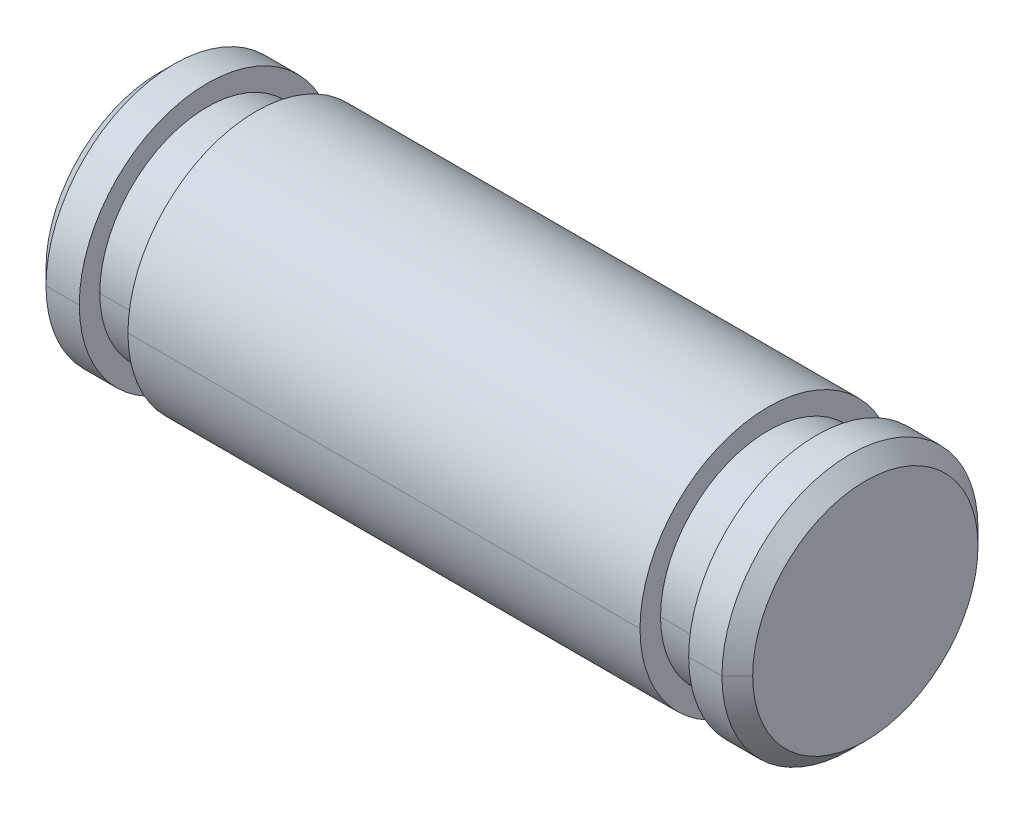
ISO-10303-21;
HEADER;
FILE_DESCRIPTION(('STEP AP214'),'2;1');
FILE_NAME('part.step','',(''),(''),'','','');
FILE_SCHEMA(('AUTOMOTIVE_DESIGN { 1 0 10303 214 1 1 1 1 }'));
ENDSEC;
DATA;
#1=APPLICATION_CONTEXT('core data for automotive mechanical design processes');
#2=APPLICATION_PROTOCOL_DEFINITION('international standard','automotive_design',2000,#1);
#3=PRODUCT_CONTEXT('',#1,'mechanical');
#4=PRODUCT('Part','Part','',(#3));
#5=PRODUCT_RELATED_PRODUCT_CATEGORY('part','',(#4));
#6=PRODUCT_DEFINITION_FORMATION('','',#4);
#7=PRODUCT_DEFINITION_CONTEXT('part definition',#1,'design');
#8=PRODUCT_DEFINITION('design','',#6,#7);
#9=PRODUCT_DEFINITION_SHAPE('','',#8);
#10=(LENGTH_UNIT() NAMED_UNIT(*) SI_UNIT(.MILLI.,.METRE.));
#11=(NAMED_UNIT(*) PLANE_ANGLE_UNIT() SI_UNIT($,.RADIAN.));
#12=(NAMED_UNIT(*) SI_UNIT($,.STERADIAN.) SOLID_ANGLE_UNIT());
#13=UNCERTAINTY_MEASURE_WITH_UNIT(LENGTH_MEASURE(1.E-05),#10,'distance_accuracy_value','');
#14=(GEOMETRIC_REPRESENTATION_CONTEXT(3) GLOBAL_UNCERTAINTY_ASSIGNED_CONTEXT((#13)) GLOBAL_UNIT_ASSIGNED_CONTEXT((#10,
#11,#12)) REPRESENTATION_CONTEXT('',''));
#15=CARTESIAN_POINT('',(0.,0.,0.));
#16=DIRECTION('',(0.,0.,1.));
#17=DIRECTION('',(1.,0.,0.));
#18=AXIS2_PLACEMENT_3D('',#15,#16,#17);
#19=CARTESIAN_POINT('',(8.382,0.,0.));
#20=DIRECTION('',(-1.,0.,0.));
#21=DIRECTION('',(0.,-1.,0.));
#22=AXIS2_PLACEMENT_3D('',#19,#20,#21);
#23=CONICAL_SURFACE('',#22,3.175,0.7853981634);
#24=CARTESIAN_POINT('',(8.763,0.,0.));
#25=DIRECTION('',(1.,0.,0.));
#26=DIRECTION('',(0.,0.,-1.));
#27=AXIS2_PLACEMENT_3D('',#24,#25,#26);
#28=CIRCLE('',#27,2.794);
#29=CARTESIAN_POINT('',(8.763,0.,-2.794));
#30=VERTEX_POINT('',#29);
#31=CARTESIAN_POINT('',(8.76299999999903,0.,2.79399999999903));
#32=VERTEX_POINT('',#31);
#33=EDGE_CURVE('E11',#30,#32,#28,.T.);
#34=ORIENTED_EDGE('',*,*,#33,.F.);
#35=DIRECTION('',(-0.707106781184743,0.,-0.707106781188353));
#36=VECTOR('',#35,1.);
#37=CARTESIAN_POINT('',(8.76299999999903,0.,-2.79399999999903));
#38=LINE('',#37,#36);
#39=CARTESIAN_POINT('',(8.382,0.,-3.175));
#40=VERTEX_POINT('',#39);
#41=EDGE_CURVE('E25',#30,#40,#38,.T.);
#42=ORIENTED_EDGE('',*,*,#41,.T.);
#43=CARTESIAN_POINT('',(8.382,0.,0.));
#44=DIRECTION('',(1.,0.,0.));
#45=DIRECTION('',(0.,0.,-1.));
#46=AXIS2_PLACEMENT_3D('',#43,#44,#45);
#47=CIRCLE('',#46,3.175);
#48=CARTESIAN_POINT('',(8.382,0.,3.175));
#49=VERTEX_POINT('',#48);
#50=EDGE_CURVE('E263',#40,#49,#47,.T.);
#51=ORIENTED_EDGE('',*,*,#50,.T.);
#52=DIRECTION('',(-0.707106781184743,0.,0.707106781188353));
#53=VECTOR('',#52,1.);
#54=CARTESIAN_POINT('',(8.76299999999903,0.,2.79399999999903));
#55=LINE('',#54,#53);
#56=EDGE_CURVE('E258',#32,#49,#55,.T.);
#57=ORIENTED_EDGE('',*,*,#56,.F.);
#58=EDGE_LOOP('',(#34,#42,#51,#57));
#59=FACE_BOUND('',#58,.T.);
#60=ADVANCED_FACE('F17',(#59),#23,.T.);
#61=CARTESIAN_POINT('',(8.382,0.,0.));
#62=DIRECTION('',(-1.,0.,0.));
#63=DIRECTION('',(0.,1.,0.));
#64=AXIS2_PLACEMENT_3D('',#61,#62,#63);
#65=CONICAL_SURFACE('',#64,3.175,0.7853981634);
#66=CARTESIAN_POINT('',(8.382,0.,0.));
#67=DIRECTION('',(1.,0.,0.));
#68=DIRECTION('',(0.,0.,-1.));
#69=AXIS2_PLACEMENT_3D('',#66,#67,#68);
#70=CIRCLE('',#69,3.175);
#71=EDGE_CURVE('E254',#49,#40,#70,.T.);
#72=ORIENTED_EDGE('',*,*,#71,.T.);
#73=ORIENTED_EDGE('',*,*,#41,.F.);
#74=CARTESIAN_POINT('',(8.763,0.,0.));
#75=DIRECTION('',(1.,0.,0.));
#76=DIRECTION('',(0.,0.,-1.));
#77=AXIS2_PLACEMENT_3D('',#74,#75,#76);
#78=CIRCLE('',#77,2.794);
#79=EDGE_CURVE('E249',#32,#30,#78,.T.);
#80=ORIENTED_EDGE('',*,*,#79,.F.);
#81=ORIENTED_EDGE('',*,*,#56,.T.);
#82=EDGE_LOOP('',(#72,#73,#80,#81));
#83=FACE_BOUND('',#82,.T.);
#84=ADVANCED_FACE('F277',(#83),#65,.T.);
#85=CARTESIAN_POINT('',(8.763,2.794,0.));
#86=DIRECTION('',(-1.,0.,0.));
#87=DIRECTION('',(0.,0.,1.));
#88=AXIS2_PLACEMENT_3D('',#85,#86,#87);
#89=PLANE('',#88);
#90=ORIENTED_EDGE('',*,*,#33,.T.);
#91=ORIENTED_EDGE('',*,*,#79,.T.);
#92=EDGE_LOOP('',(#90,#91));
#93=FACE_BOUND('',#92,.T.);
#94=ADVANCED_FACE('F355',(#93),#89,.F.);
#95=CARTESIAN_POINT('',(8.763,0.,0.));
#96=DIRECTION('',(-1.,0.,0.));
#97=DIRECTION('',(0.,1.,0.));
#98=AXIS2_PLACEMENT_3D('',#95,#96,#97);
#99=CYLINDRICAL_SURFACE('',#98,3.175);
#100=CARTESIAN_POINT('',(7.5565,0.,0.));
#101=DIRECTION('',(1.,0.,0.));
#102=DIRECTION('',(0.,0.,-1.));
#103=AXIS2_PLACEMENT_3D('',#100,#101,#102);
#104=CIRCLE('',#103,3.175);
#105=CARTESIAN_POINT('',(7.5565,0.,3.175));
#106=VERTEX_POINT('',#105);
#107=CARTESIAN_POINT('',(7.5565,0.,-3.175));
#108=VERTEX_POINT('',#107);
#109=EDGE_CURVE('E245',#106,#108,#104,.T.);
#110=ORIENTED_EDGE('',*,*,#109,.T.);
#111=DIRECTION('',(-1.,0.,0.));
#112=VECTOR('',#111,1.);
#113=CARTESIAN_POINT('',(8.382,0.,-3.175));
#114=LINE('',#113,#112);
#115=EDGE_CURVE('E240',#40,#108,#114,.T.);
#116=ORIENTED_EDGE('',*,*,#115,.F.);
#117=ORIENTED_EDGE('',*,*,#71,.F.);
#118=DIRECTION('',(-1.,0.,0.));
#119=VECTOR('',#118,1.);
#120=CARTESIAN_POINT('',(8.382,0.,3.175));
#121=LINE('',#120,#119);
#122=EDGE_CURVE('E236',#49,#106,#121,.T.);
#123=ORIENTED_EDGE('',*,*,#122,.T.);
#124=EDGE_LOOP('',(#110,#116,#117,#123));
#125=FACE_BOUND('',#124,.T.);
#126=ADVANCED_FACE('F280',(#125),#99,.T.);
#127=CARTESIAN_POINT('',(8.763,0.,0.));
#128=DIRECTION('',(-1.,0.,0.));
#129=DIRECTION('',(0.,-1.,0.));
#130=AXIS2_PLACEMENT_3D('',#127,#128,#129);
#131=CYLINDRICAL_SURFACE('',#130,3.175);
#132=ORIENTED_EDGE('',*,*,#50,.F.);
#133=ORIENTED_EDGE('',*,*,#115,.T.);
#134=CARTESIAN_POINT('',(7.5565,0.,0.));
#135=DIRECTION('',(1.,0.,0.));
#136=DIRECTION('',(0.,0.,-1.));
#137=AXIS2_PLACEMENT_3D('',#134,#135,#136);
#138=CIRCLE('',#137,3.175);
#139=EDGE_CURVE('E231',#108,#106,#138,.T.);
#140=ORIENTED_EDGE('',*,*,#139,.T.);
#141=ORIENTED_EDGE('',*,*,#122,.F.);
#142=EDGE_LOOP('',(#132,#133,#140,#141));
#143=FACE_BOUND('',#142,.T.);
#144=ADVANCED_FACE('F281',(#143),#131,.T.);
#145=CARTESIAN_POINT('',(7.5565,2.667,0.));
#146=DIRECTION('',(1.,0.,0.));
#147=DIRECTION('',(0.,0.,-1.));
#148=AXIS2_PLACEMENT_3D('',#145,#146,#147);
#149=PLANE('',#148);
#150=ORIENTED_EDGE('',*,*,#139,.F.);
#151=ORIENTED_EDGE('',*,*,#109,.F.);
#152=EDGE_LOOP('',(#150,#151));
#153=FACE_BOUND('',#152,.T.);
#154=CARTESIAN_POINT('',(7.5565,0.,0.));
#155=DIRECTION('',(1.,0.,0.));
#156=DIRECTION('',(0.,0.,-1.));
#157=AXIS2_PLACEMENT_3D('',#154,#155,#156);
#158=CIRCLE('',#157,2.667);
#159=CARTESIAN_POINT('',(7.5565,0.,-2.667));
#160=VERTEX_POINT('',#159);
#161=CARTESIAN_POINT('',(7.5565,0.,2.667));
#162=VERTEX_POINT('',#161);
#163=EDGE_CURVE('E227',#160,#162,#158,.T.);
#164=ORIENTED_EDGE('',*,*,#163,.T.);
#165=CARTESIAN_POINT('',(7.5565,0.,0.));
#166=DIRECTION('',(1.,0.,0.));
#167=DIRECTION('',(0.,0.,-1.));
#168=AXIS2_PLACEMENT_3D('',#165,#166,#167);
#169=CIRCLE('',#168,2.667);
#170=EDGE_CURVE('E223',#162,#160,#169,.T.);
#171=ORIENTED_EDGE('',*,*,#170,.T.);
#172=EDGE_LOOP('',(#164,#171));
#173=FACE_BOUND('',#172,.T.);
#174=ADVANCED_FACE('F285',(#153,#173),#149,.F.);
#175=CARTESIAN_POINT('',(8.763,0.,0.));
#176=DIRECTION('',(-1.,0.,0.));
#177=DIRECTION('',(0.,1.,0.));
#178=AXIS2_PLACEMENT_3D('',#175,#176,#177);
#179=CYLINDRICAL_SURFACE('',#178,2.667);
#180=CARTESIAN_POINT('',(6.35,0.,0.));
#181=DIRECTION('',(1.,0.,0.));
#182=DIRECTION('',(0.,0.,-1.));
#183=AXIS2_PLACEMENT_3D('',#180,#181,#182);
#184=CIRCLE('',#183,2.667);
#185=CARTESIAN_POINT('',(6.35,0.,2.667));
#186=VERTEX_POINT('',#185);
#187=CARTESIAN_POINT('',(6.35,0.,-2.667));
#188=VERTEX_POINT('',#187);
#189=EDGE_CURVE('E219',#186,#188,#184,.T.);
#190=ORIENTED_EDGE('',*,*,#189,.T.);
#191=DIRECTION('',(-1.,0.,0.));
#192=VECTOR('',#191,1.);
#193=CARTESIAN_POINT('',(7.5565,0.,-2.667));
#194=LINE('',#193,#192);
#195=EDGE_CURVE('E214',#160,#188,#194,.T.);
#196=ORIENTED_EDGE('',*,*,#195,.F.);
#197=ORIENTED_EDGE('',*,*,#170,.F.);
#198=DIRECTION('',(-1.,0.,0.));
#199=VECTOR('',#198,1.);
#200=CARTESIAN_POINT('',(7.5565,0.,2.667));
#201=LINE('',#200,#199);
#202=EDGE_CURVE('E210',#162,#186,#201,.T.);
#203=ORIENTED_EDGE('',*,*,#202,.T.);
#204=EDGE_LOOP('',(#190,#196,#197,#203));
#205=FACE_BOUND('',#204,.T.);
#206=ADVANCED_FACE('F288',(#205),#179,.T.);
#207=CARTESIAN_POINT('',(8.763,0.,0.));
#208=DIRECTION('',(-1.,0.,0.));
#209=DIRECTION('',(0.,-1.,0.));
#210=AXIS2_PLACEMENT_3D('',#207,#208,#209);
#211=CYLINDRICAL_SURFACE('',#210,2.667);
#212=ORIENTED_EDGE('',*,*,#163,.F.);
#213=ORIENTED_EDGE('',*,*,#195,.T.);
#214=CARTESIAN_POINT('',(6.35,0.,0.));
#215=DIRECTION('',(1.,0.,0.));
#216=DIRECTION('',(0.,0.,-1.));
#217=AXIS2_PLACEMENT_3D('',#214,#215,#216);
#218=CIRCLE('',#217,2.667);
#219=EDGE_CURVE('E205',#188,#186,#218,.T.);
#220=ORIENTED_EDGE('',*,*,#219,.T.);
#221=ORIENTED_EDGE('',*,*,#202,.F.);
#222=EDGE_LOOP('',(#212,#213,#220,#221));
#223=FACE_BOUND('',#222,.T.);
#224=ADVANCED_FACE('F296',(#223),#211,.T.);
#225=CARTESIAN_POINT('',(6.35,3.175,0.));
#226=DIRECTION('',(-1.,0.,0.));
#227=DIRECTION('',(0.,0.,1.));
#228=AXIS2_PLACEMENT_3D('',#225,#226,#227);
#229=PLANE('',#228);
#230=ORIENTED_EDGE('',*,*,#219,.F.);
#231=ORIENTED_EDGE('',*,*,#189,.F.);
#232=EDGE_LOOP('',(#230,#231));
#233=FACE_BOUND('',#232,.T.);
#234=CARTESIAN_POINT('',(6.35,0.,0.));
#235=DIRECTION('',(1.,0.,0.));
#236=DIRECTION('',(0.,0.,-1.));
#237=AXIS2_PLACEMENT_3D('',#234,#235,#236);
#238=CIRCLE('',#237,3.175);
#239=CARTESIAN_POINT('',(6.35,0.,-3.175));
#240=VERTEX_POINT('',#239);
#241=CARTESIAN_POINT('',(6.35,0.,3.175));
#242=VERTEX_POINT('',#241);
#243=EDGE_CURVE('E201',#240,#242,#238,.T.);
#244=ORIENTED_EDGE('',*,*,#243,.T.);
#245=CARTESIAN_POINT('',(6.35,0.,0.));
#246=DIRECTION('',(1.,0.,0.));
#247=DIRECTION('',(0.,0.,-1.));
#248=AXIS2_PLACEMENT_3D('',#245,#246,#247);
#249=CIRCLE('',#248,3.175);
#250=EDGE_CURVE('E197',#242,#240,#249,.T.);
#251=ORIENTED_EDGE('',*,*,#250,.T.);
#252=EDGE_LOOP('',(#244,#251));
#253=FACE_BOUND('',#252,.T.);
#254=ADVANCED_FACE('F300',(#233,#253),#229,.F.);
#255=CARTESIAN_POINT('',(8.763,0.,0.));
#256=DIRECTION('',(-1.,0.,0.));
#257=DIRECTION('',(0.,1.,0.));
#258=AXIS2_PLACEMENT_3D('',#255,#256,#257);
#259=CYLINDRICAL_SURFACE('',#258,3.175);
#260=CARTESIAN_POINT('',(-6.35,0.,0.));
#261=DIRECTION('',(1.,0.,0.));
#262=DIRECTION('',(0.,0.,-1.));
#263=AXIS2_PLACEMENT_3D('',#260,#261,#262);
#264=CIRCLE('',#263,3.175);
#265=CARTESIAN_POINT('',(-6.35,0.,3.175));
#266=VERTEX_POINT('',#265);
#267=CARTESIAN_POINT('',(-6.35,0.,-3.175));
#268=VERTEX_POINT('',#267);
#269=EDGE_CURVE('E193',#266,#268,#264,.T.);
#270=ORIENTED_EDGE('',*,*,#269,.T.);
#271=DIRECTION('',(-1.,0.,0.));
#272=VECTOR('',#271,1.);
#273=CARTESIAN_POINT('',(6.35,0.,-3.175));
#274=LINE('',#273,#272);
#275=EDGE_CURVE('E188',#240,#268,#274,.T.);
#276=ORIENTED_EDGE('',*,*,#275,.F.);
#277=ORIENTED_EDGE('',*,*,#250,.F.);
#278=DIRECTION('',(-1.,0.,0.));
#279=VECTOR('',#278,1.);
#280=CARTESIAN_POINT('',(6.35,0.,3.175));
#281=LINE('',#280,#279);
#282=EDGE_CURVE('E184',#242,#266,#281,.T.);
#283=ORIENTED_EDGE('',*,*,#282,.T.);
#284=EDGE_LOOP('',(#270,#276,#277,#283));
#285=FACE_BOUND('',#284,.T.);
#286=ADVANCED_FACE('F303',(#285),#259,.T.);
#287=CARTESIAN_POINT('',(8.763,0.,0.));
#288=DIRECTION('',(-1.,0.,0.));
#289=DIRECTION('',(0.,-1.,0.));
#290=AXIS2_PLACEMENT_3D('',#287,#288,#289);
#291=CYLINDRICAL_SURFACE('',#290,3.175);
#292=ORIENTED_EDGE('',*,*,#243,.F.);
#293=ORIENTED_EDGE('',*,*,#275,.T.);
#294=CARTESIAN_POINT('',(-6.35,0.,0.));
#295=DIRECTION('',(1.,0.,0.));
#296=DIRECTION('',(0.,0.,-1.));
#297=AXIS2_PLACEMENT_3D('',#294,#295,#296);
#298=CIRCLE('',#297,3.175);
#299=EDGE_CURVE('E179',#268,#266,#298,.T.);
#300=ORIENTED_EDGE('',*,*,#299,.T.);
#301=ORIENTED_EDGE('',*,*,#282,.F.);
#302=EDGE_LOOP('',(#292,#293,#300,#301));
#303=FACE_BOUND('',#302,.T.);
#304=ADVANCED_FACE('F311',(#303),#291,.T.);
#305=CARTESIAN_POINT('',(-6.35,2.667,0.));
#306=DIRECTION('',(1.,0.,0.));
#307=DIRECTION('',(0.,0.,-1.));
#308=AXIS2_PLACEMENT_3D('',#305,#306,#307);
#309=PLANE('',#308);
#310=ORIENTED_EDGE('',*,*,#299,.F.);
#311=ORIENTED_EDGE('',*,*,#269,.F.);
#312=EDGE_LOOP('',(#310,#311));
#313=FACE_BOUND('',#312,.T.);
#314=CARTESIAN_POINT('',(-6.35,0.,0.));
#315=DIRECTION('',(1.,0.,0.));
#316=DIRECTION('',(0.,0.,-1.));
#317=AXIS2_PLACEMENT_3D('',#314,#315,#316);
#318=CIRCLE('',#317,2.667);
#319=CARTESIAN_POINT('',(-6.35,0.,-2.667));
#320=VERTEX_POINT('',#319);
#321=CARTESIAN_POINT('',(-6.35,0.,2.667));
#322=VERTEX_POINT('',#321);
#323=EDGE_CURVE('E175',#320,#322,#318,.T.);
#324=ORIENTED_EDGE('',*,*,#323,.T.);
#325=CARTESIAN_POINT('',(-6.35,0.,0.));
#326=DIRECTION('',(1.,0.,0.));
#327=DIRECTION('',(0.,0.,-1.));
#328=AXIS2_PLACEMENT_3D('',#325,#326,#327);
#329=CIRCLE('',#328,2.667);
#330=EDGE_CURVE('E171',#322,#320,#329,.T.);
#331=ORIENTED_EDGE('',*,*,#330,.T.);
#332=EDGE_LOOP('',(#324,#331));
#333=FACE_BOUND('',#332,.T.);
#334=ADVANCED_FACE('F315',(#313,#333),#309,.F.);
#335=CARTESIAN_POINT('',(8.763,0.,0.));
#336=DIRECTION('',(-1.,0.,0.));
#337=DIRECTION('',(0.,1.,0.));
#338=AXIS2_PLACEMENT_3D('',#335,#336,#337);
#339=CYLINDRICAL_SURFACE('',#338,2.667);
#340=CARTESIAN_POINT('',(-7.5565,0.,0.));
#341=DIRECTION('',(1.,0.,0.));
#342=DIRECTION('',(0.,0.,-1.));
#343=AXIS2_PLACEMENT_3D('',#340,#341,#342);
#344=CIRCLE('',#343,2.667);
#345=CARTESIAN_POINT('',(-7.5565,0.,2.667));
#346=VERTEX_POINT('',#345);
#347=CARTESIAN_POINT('',(-7.5565,0.,-2.667));
#348=VERTEX_POINT('',#347);
#349=EDGE_CURVE('E167',#346,#348,#344,.T.);
#350=ORIENTED_EDGE('',*,*,#349,.T.);
#351=DIRECTION('',(-1.,0.,0.));
#352=VECTOR('',#351,1.);
#353=CARTESIAN_POINT('',(-6.35,0.,-2.667));
#354=LINE('',#353,#352);
#355=EDGE_CURVE('E162',#320,#348,#354,.T.);
#356=ORIENTED_EDGE('',*,*,#355,.F.);
#357=ORIENTED_EDGE('',*,*,#330,.F.);
#358=DIRECTION('',(-1.,0.,0.));
#359=VECTOR('',#358,1.);
#360=CARTESIAN_POINT('',(-6.35,0.,2.667));
#361=LINE('',#360,#359);
#362=EDGE_CURVE('E158',#322,#346,#361,.T.);
#363=ORIENTED_EDGE('',*,*,#362,.T.);
#364=EDGE_LOOP('',(#350,#356,#357,#363));
#365=FACE_BOUND('',#364,.T.);
#366=ADVANCED_FACE('F318',(#365),#339,.T.);
#367=CARTESIAN_POINT('',(8.763,0.,0.));
#368=DIRECTION('',(-1.,0.,0.));
#369=DIRECTION('',(0.,-1.,0.));
#370=AXIS2_PLACEMENT_3D('',#367,#368,#369);
#371=CYLINDRICAL_SURFACE('',#370,2.667);
#372=ORIENTED_EDGE('',*,*,#323,.F.);
#373=ORIENTED_EDGE('',*,*,#355,.T.);
#374=CARTESIAN_POINT('',(-7.5565,0.,0.));
#375=DIRECTION('',(1.,0.,0.));
#376=DIRECTION('',(0.,0.,-1.));
#377=AXIS2_PLACEMENT_3D('',#374,#375,#376);
#378=CIRCLE('',#377,2.667);
#379=EDGE_CURVE('E153',#348,#346,#378,.T.);
#380=ORIENTED_EDGE('',*,*,#379,.T.);
#381=ORIENTED_EDGE('',*,*,#362,.F.);
#382=EDGE_LOOP('',(#372,#373,#380,#381));
#383=FACE_BOUND('',#382,.T.);
#384=ADVANCED_FACE('F326',(#383),#371,.T.);
#385=CARTESIAN_POINT('',(-7.5565,3.175,0.));
#386=DIRECTION('',(-1.,0.,0.));
#387=DIRECTION('',(0.,0.,1.));
#388=AXIS2_PLACEMENT_3D('',#385,#386,#387);
#389=PLANE('',#388);
#390=ORIENTED_EDGE('',*,*,#379,.F.);
#391=ORIENTED_EDGE('',*,*,#349,.F.);
#392=EDGE_LOOP('',(#390,#391));
#393=FACE_BOUND('',#392,.T.);
#394=CARTESIAN_POINT('',(-7.5565,0.,0.));
#395=DIRECTION('',(1.,0.,0.));
#396=DIRECTION('',(0.,0.,-1.));
#397=AXIS2_PLACEMENT_3D('',#394,#395,#396);
#398=CIRCLE('',#397,3.175);
#399=CARTESIAN_POINT('',(-7.5565,0.,-3.175));
#400=VERTEX_POINT('',#399);
#401=CARTESIAN_POINT('',(-7.5565,0.,3.175));
#402=VERTEX_POINT('',#401);
#403=EDGE_CURVE('E149',#400,#402,#398,.T.);
#404=ORIENTED_EDGE('',*,*,#403,.T.);
#405=CARTESIAN_POINT('',(-7.5565,0.,0.));
#406=DIRECTION('',(1.,0.,0.));
#407=DIRECTION('',(0.,0.,-1.));
#408=AXIS2_PLACEMENT_3D('',#405,#406,#407);
#409=CIRCLE('',#408,3.175);
#410=EDGE_CURVE('E145',#402,#400,#409,.T.);
#411=ORIENTED_EDGE('',*,*,#410,.T.);
#412=EDGE_LOOP('',(#404,#411));
#413=FACE_BOUND('',#412,.T.);
#414=ADVANCED_FACE('F330',(#393,#413),#389,.F.);
#415=CARTESIAN_POINT('',(8.763,0.,0.));
#416=DIRECTION('',(-1.,0.,0.));
#417=DIRECTION('',(0.,1.,0.));
#418=AXIS2_PLACEMENT_3D('',#415,#416,#417);
#419=CYLINDRICAL_SURFACE('',#418,3.175);
#420=CARTESIAN_POINT('',(-8.382,0.,0.));
#421=DIRECTION('',(1.,0.,0.));
#422=DIRECTION('',(0.,0.,-1.));
#423=AXIS2_PLACEMENT_3D('',#420,#421,#422);
#424=CIRCLE('',#423,3.175);
#425=CARTESIAN_POINT('',(-8.382,0.,3.175));
#426=VERTEX_POINT('',#425);
#427=CARTESIAN_POINT('',(-8.382,0.,-3.175));
#428=VERTEX_POINT('',#427);
#429=EDGE_CURVE('E116',#426,#428,#424,.T.);
#430=ORIENTED_EDGE('',*,*,#429,.T.);
#431=DIRECTION('',(-1.,0.,0.));
#432=VECTOR('',#431,1.);
#433=CARTESIAN_POINT('',(-7.5565,0.,-3.175));
#434=LINE('',#433,#432);
#435=EDGE_CURVE('E137',#400,#428,#434,.T.);
#436=ORIENTED_EDGE('',*,*,#435,.F.);
#437=ORIENTED_EDGE('',*,*,#410,.F.);
#438=DIRECTION('',(-1.,0.,0.));
#439=VECTOR('',#438,1.);
#440=CARTESIAN_POINT('',(-7.5565,0.,3.175));
#441=LINE('',#440,#439);
#442=EDGE_CURVE('E133',#402,#426,#441,.T.);
#443=ORIENTED_EDGE('',*,*,#442,.T.);
#444=EDGE_LOOP('',(#430,#436,#437,#443));
#445=FACE_BOUND('',#444,.T.);
#446=ADVANCED_FACE('F333',(#445),#419,.T.);
#447=CARTESIAN_POINT('',(8.763,0.,0.));
#448=DIRECTION('',(-1.,0.,0.));
#449=DIRECTION('',(0.,-1.,0.));
#450=AXIS2_PLACEMENT_3D('',#447,#448,#449);
#451=CYLINDRICAL_SURFACE('',#450,3.175);
#452=ORIENTED_EDGE('',*,*,#403,.F.);
#453=ORIENTED_EDGE('',*,*,#435,.T.);
#454=CARTESIAN_POINT('',(-8.382,0.,0.));
#455=DIRECTION('',(1.,0.,0.));
#456=DIRECTION('',(0.,0.,-1.));
#457=AXIS2_PLACEMENT_3D('',#454,#455,#456);
#458=CIRCLE('',#457,3.175);
#459=EDGE_CURVE('E128',#428,#426,#458,.T.);
#460=ORIENTED_EDGE('',*,*,#459,.T.);
#461=ORIENTED_EDGE('',*,*,#442,.F.);
#462=EDGE_LOOP('',(#452,#453,#460,#461));
#463=FACE_BOUND('',#462,.T.);
#464=ADVANCED_FACE('F341',(#463),#451,.T.);
#465=CARTESIAN_POINT('',(-8.763,0.,0.));
#466=DIRECTION('',(1.,0.,0.));
#467=DIRECTION('',(0.,-1.,0.));
#468=AXIS2_PLACEMENT_3D('',#465,#466,#467);
#469=CONICAL_SURFACE('',#468,2.794,0.7853981634);
#470=ORIENTED_EDGE('',*,*,#459,.F.);
#471=DIRECTION('',(0.707106781184743,0.,-0.707106781188353));
#472=VECTOR('',#471,1.);
#473=CARTESIAN_POINT('',(-8.763,0.,-2.794));
#474=LINE('',#473,#472);
#475=CARTESIAN_POINT('',(-8.763,0.,-2.794));
#476=VERTEX_POINT('',#475);
#477=EDGE_CURVE('E108',#476,#428,#474,.T.);
#478=ORIENTED_EDGE('',*,*,#477,.F.);
#479=CARTESIAN_POINT('',(-8.763,0.,0.));
#480=DIRECTION('',(1.,0.,0.));
#481=DIRECTION('',(0.,0.,-1.));
#482=AXIS2_PLACEMENT_3D('',#479,#480,#481);
#483=CIRCLE('',#482,2.794);
#484=CARTESIAN_POINT('',(-8.763,0.,2.794));
#485=VERTEX_POINT('',#484);
#486=EDGE_CURVE('E101',#476,#485,#483,.T.);
#487=ORIENTED_EDGE('',*,*,#486,.T.);
#488=DIRECTION('',(0.707106781184743,0.,0.707106781188353));
#489=VECTOR('',#488,1.);
#490=CARTESIAN_POINT('',(-8.763,0.,2.794));
#491=LINE('',#490,#489);
#492=EDGE_CURVE('E105',#485,#426,#491,.T.);
#493=ORIENTED_EDGE('',*,*,#492,.T.);
#494=EDGE_LOOP('',(#470,#478,#487,#493));
#495=FACE_BOUND('',#494,.T.);
#496=ADVANCED_FACE('F104',(#495),#469,.T.);
#497=CARTESIAN_POINT('',(-8.763,0.,0.));
#498=DIRECTION('',(1.,0.,0.));
#499=DIRECTION('',(0.,1.,0.));
#500=AXIS2_PLACEMENT_3D('',#497,#498,#499);
#501=CONICAL_SURFACE('',#500,2.794,0.7853981634);
#502=CARTESIAN_POINT('',(-8.763,0.,0.));
#503=DIRECTION('',(1.,0.,0.));
#504=DIRECTION('',(0.,0.,-1.));
#505=AXIS2_PLACEMENT_3D('',#502,#503,#504);
#506=CIRCLE('',#505,2.794);
#507=EDGE_CURVE('E115',#485,#476,#506,.T.);
#508=ORIENTED_EDGE('',*,*,#507,.T.);
#509=ORIENTED_EDGE('',*,*,#477,.T.);
#510=ORIENTED_EDGE('',*,*,#429,.F.);
#511=ORIENTED_EDGE('',*,*,#492,.F.);
#512=EDGE_LOOP('',(#508,#509,#510,#511));
#513=FACE_BOUND('',#512,.T.);
#514=ADVANCED_FACE('F114',(#513),#501,.T.);
#515=CARTESIAN_POINT('',(-8.763,0.,0.));
#516=DIRECTION('',(1.,0.,0.));
#517=DIRECTION('',(0.,0.,-1.));
#518=AXIS2_PLACEMENT_3D('',#515,#516,#517);
#519=PLANE('',#518);
#520=ORIENTED_EDGE('',*,*,#486,.F.);
#521=ORIENTED_EDGE('',*,*,#507,.F.);
#522=EDGE_LOOP('',(#520,#521));
#523=FACE_BOUND('',#522,.T.);
#524=ADVANCED_FACE('F118',(#523),#519,.F.);
#525=CLOSED_SHELL('',(#60,#84,#94,#126,#144,#174,#206,#224,#254,#286,#304,#334,#366,#384,#414,
#446,#464,#496,#514,#524));
#526=MANIFOLD_SOLID_BREP('B1',#525);
#527=ADVANCED_BREP_SHAPE_REPRESENTATION('',(#18,#526),#14);
#528=SHAPE_DEFINITION_REPRESENTATION(#9,#527);
ENDSEC;
END-ISO-10303-21;
